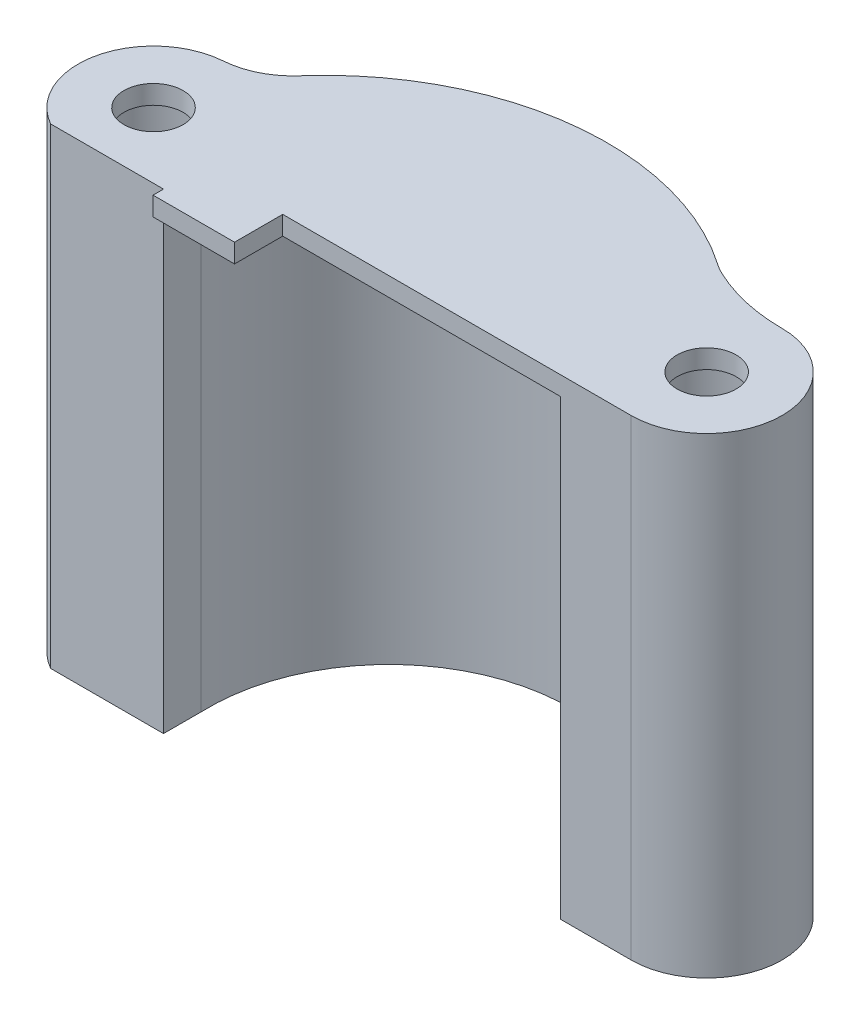
ISO-10303-21;
HEADER;
FILE_DESCRIPTION(('STEP AP214'),'2;1');
FILE_NAME('part.step','',(''),(''),'','','');
FILE_SCHEMA(('AUTOMOTIVE_DESIGN { 1 0 10303 214 1 1 1 1 }'));
ENDSEC;
DATA;
#1=APPLICATION_CONTEXT('core data for automotive mechanical design processes');
#2=APPLICATION_PROTOCOL_DEFINITION('international standard','automotive_design',2000,#1);
#3=PRODUCT_CONTEXT('',#1,'mechanical');
#4=PRODUCT('Part','Part','',(#3));
#5=PRODUCT_RELATED_PRODUCT_CATEGORY('part','',(#4));
#6=PRODUCT_DEFINITION_FORMATION('','',#4);
#7=PRODUCT_DEFINITION_CONTEXT('part definition',#1,'design');
#8=PRODUCT_DEFINITION('design','',#6,#7);
#9=PRODUCT_DEFINITION_SHAPE('','',#8);
#10=(LENGTH_UNIT() NAMED_UNIT(*) SI_UNIT(.MILLI.,.METRE.));
#11=(NAMED_UNIT(*) PLANE_ANGLE_UNIT() SI_UNIT($,.RADIAN.));
#12=(NAMED_UNIT(*) SI_UNIT($,.STERADIAN.) SOLID_ANGLE_UNIT());
#13=UNCERTAINTY_MEASURE_WITH_UNIT(LENGTH_MEASURE(1.E-05),#10,'distance_accuracy_value','');
#14=(GEOMETRIC_REPRESENTATION_CONTEXT(3) GLOBAL_UNCERTAINTY_ASSIGNED_CONTEXT((#13)) GLOBAL_UNIT_ASSIGNED_CONTEXT((#10,
#11,#12)) REPRESENTATION_CONTEXT('',''));
#15=CARTESIAN_POINT('',(0.,0.,0.));
#16=DIRECTION('',(0.,0.,1.));
#17=DIRECTION('',(1.,0.,0.));
#18=AXIS2_PLACEMENT_3D('',#15,#16,#17);
#19=CARTESIAN_POINT('',(-13.6378226737925,38.1,0.));
#20=DIRECTION('',(-1.,0.,0.));
#21=DIRECTION('',(0.,0.,1.));
#22=AXIS2_PLACEMENT_3D('',#19,#20,#21);
#23=PLANE('',#22);
#24=DIRECTION('',(0.,0.,1.));
#25=VECTOR('',#24,1.);
#26=CARTESIAN_POINT('',(-13.6378226737925,38.1,0.));
#27=LINE('',#26,#25);
#28=CARTESIAN_POINT('',(-13.6378226737925,38.1,15.7404965999173));
#29=VERTEX_POINT('',#28);
#30=CARTESIAN_POINT('',(-13.6378226737925,38.1,18.9154965999173));
#31=VERTEX_POINT('',#30);
#32=EDGE_CURVE('E280',#29,#31,#27,.T.);
#33=ORIENTED_EDGE('',*,*,#32,.T.);
#34=DIRECTION('',(0.,-1.,0.));
#35=VECTOR('',#34,1.);
#36=CARTESIAN_POINT('',(-13.6378226737925,38.1,18.9154965999173));
#37=LINE('',#36,#35);
#38=CARTESIAN_POINT('',(-13.6378226737925,0.,18.9154965999173));
#39=VERTEX_POINT('',#38);
#40=EDGE_CURVE('E236',#31,#39,#37,.T.);
#41=ORIENTED_EDGE('',*,*,#40,.T.);
#42=DIRECTION('',(0.,0.,-1.));
#43=VECTOR('',#42,1.);
#44=CARTESIAN_POINT('',(-13.6378226737925,0.,0.));
#45=LINE('',#44,#43);
#46=CARTESIAN_POINT('',(-13.6378226737925,0.,15.7404965999173));
#47=VERTEX_POINT('',#46);
#48=EDGE_CURVE('E206',#39,#47,#45,.T.);
#49=ORIENTED_EDGE('',*,*,#48,.T.);
#50=DIRECTION('',(0.,-1.,0.));
#51=VECTOR('',#50,1.);
#52=CARTESIAN_POINT('',(-13.6378226737925,38.1,15.7404965999173));
#53=LINE('',#52,#51);
#54=EDGE_CURVE('E233',#29,#47,#53,.T.);
#55=ORIENTED_EDGE('',*,*,#54,.F.);
#56=EDGE_LOOP('',(#33,#41,#49,#55));
#57=FACE_BOUND('',#56,.T.);
#58=ADVANCED_FACE('F38',(#57),#23,.F.);
#59=CARTESIAN_POINT('',(0.,38.1,15.7404965999173));
#60=DIRECTION('',(0.,0.,-1.));
#61=DIRECTION('',(-1.,0.,0.));
#62=AXIS2_PLACEMENT_3D('',#59,#60,#61);
#63=PLANE('',#62);
#64=DIRECTION('',(0.,1.,0.));
#65=VECTOR('',#64,1.);
#66=CARTESIAN_POINT('',(-6.77982267379246,17.7380475663924,15.7404965999173));
#67=LINE('',#66,#65);
#68=CARTESIAN_POINT('',(-6.77982267379246,38.1,15.7404965999173));
#69=VERTEX_POINT('',#68);
#70=CARTESIAN_POINT('',(-6.77982267379246,39.6875,15.7404965999173));
#71=VERTEX_POINT('',#70);
#72=EDGE_CURVE('E141',#69,#71,#67,.T.);
#73=ORIENTED_EDGE('',*,*,#72,.F.);
#74=DIRECTION('',(1.,0.,0.));
#75=VECTOR('',#74,1.);
#76=CARTESIAN_POINT('',(-13.6378226737925,38.1,15.7404965999173));
#77=LINE('',#76,#75);
#78=CARTESIAN_POINT('',(16.6090859378619,38.1,15.7404965999173));
#79=VERTEX_POINT('',#78);
#80=EDGE_CURVE('E168',#69,#79,#77,.T.);
#81=ORIENTED_EDGE('',*,*,#80,.T.);
#82=DIRECTION('',(0.,-1.,0.));
#83=VECTOR('',#82,1.);
#84=CARTESIAN_POINT('',(16.6090859378619,38.1,15.7404965999173));
#85=LINE('',#84,#83);
#86=CARTESIAN_POINT('',(16.6090859378619,0.,15.7404965999173));
#87=VERTEX_POINT('',#86);
#88=EDGE_CURVE('E228',#79,#87,#85,.T.);
#89=ORIENTED_EDGE('',*,*,#88,.T.);
#90=DIRECTION('',(1.,0.,0.));
#91=VECTOR('',#90,1.);
#92=CARTESIAN_POINT('',(0.,0.,15.7404965999173));
#93=LINE('',#92,#91);
#94=CARTESIAN_POINT('',(22.5456913931761,0.,15.7404965999173));
#95=VERTEX_POINT('',#94);
#96=EDGE_CURVE('E213',#87,#95,#93,.T.);
#97=ORIENTED_EDGE('',*,*,#96,.T.);
#98=DIRECTION('',(0.,-1.,0.));
#99=VECTOR('',#98,1.);
#100=CARTESIAN_POINT('',(22.5456913931761,38.1,15.7404965999173));
#101=LINE('',#100,#99);
#102=CARTESIAN_POINT('',(22.5456913931761,39.6875,15.7404965999173));
#103=VERTEX_POINT('',#102);
#104=EDGE_CURVE('E165',#103,#95,#101,.T.);
#105=ORIENTED_EDGE('',*,*,#104,.F.);
#106=DIRECTION('',(1.,0.,0.));
#107=VECTOR('',#106,1.);
#108=CARTESIAN_POINT('',(16.6090859378619,39.6875,15.7404965999173));
#109=LINE('',#108,#107);
#110=EDGE_CURVE('E157',#71,#103,#109,.T.);
#111=ORIENTED_EDGE('',*,*,#110,.F.);
#112=EDGE_LOOP('',(#73,#81,#89,#97,#105,#111));
#113=FACE_BOUND('',#112,.T.);
#114=ADVANCED_FACE('F163',(#113),#63,.F.);
#115=CARTESIAN_POINT('',(16.6090859378619,38.1,0.));
#116=DIRECTION('',(1.,0.,0.));
#117=DIRECTION('',(0.,0.,-1.));
#118=AXIS2_PLACEMENT_3D('',#115,#116,#117);
#119=PLANE('',#118);
#120=DIRECTION('',(0.,0.,-1.));
#121=VECTOR('',#120,1.);
#122=CARTESIAN_POINT('',(16.6090859378619,38.1,0.));
#123=LINE('',#122,#121);
#124=CARTESIAN_POINT('',(16.6090859378619,38.1,12.5654965999173));
#125=VERTEX_POINT('',#124);
#126=EDGE_CURVE('E291',#79,#125,#123,.T.);
#127=ORIENTED_EDGE('',*,*,#126,.T.);
#128=DIRECTION('',(0.,-1.,0.));
#129=VECTOR('',#128,1.);
#130=CARTESIAN_POINT('',(16.6090859378619,38.1,12.5654965999173));
#131=LINE('',#130,#129);
#132=CARTESIAN_POINT('',(16.6090859378619,0.,12.5654965999173));
#133=VERTEX_POINT('',#132);
#134=EDGE_CURVE('E230',#125,#133,#131,.T.);
#135=ORIENTED_EDGE('',*,*,#134,.T.);
#136=DIRECTION('',(0.,0.,1.));
#137=VECTOR('',#136,1.);
#138=CARTESIAN_POINT('',(16.6090859378619,0.,0.));
#139=LINE('',#138,#137);
#140=EDGE_CURVE('E210',#133,#87,#139,.T.);
#141=ORIENTED_EDGE('',*,*,#140,.T.);
#142=ORIENTED_EDGE('',*,*,#88,.F.);
#143=EDGE_LOOP('',(#127,#135,#141,#142));
#144=FACE_BOUND('',#143,.T.);
#145=ADVANCED_FACE('F330',(#144),#119,.F.);
#146=CARTESIAN_POINT('',(1.66297527786936,38.1,20.6134230140809));
#147=DIRECTION('',(0.,-1.,0.));
#148=DIRECTION('',(0.,0.,-1.));
#149=AXIS2_PLACEMENT_3D('',#146,#147,#148);
#150=CYLINDRICAL_SURFACE('',#149,23.746023500555);
#151=CARTESIAN_POINT('',(1.66297527786936,39.6875,20.6134230140809));
#152=DIRECTION('',(0.,1.,0.));
#153=DIRECTION('',(0.,0.,1.));
#154=AXIS2_PLACEMENT_3D('',#151,#152,#153);
#155=CIRCLE('',#154,23.746023500555);
#156=CARTESIAN_POINT('',(15.1487765830653,39.6875,1.06842889165444));
#157=VERTEX_POINT('',#156);
#158=CARTESIAN_POINT('',(-16.1639042572107,39.6875,4.92661332789374));
#159=VERTEX_POINT('',#158);
#160=EDGE_CURVE('E180',#157,#159,#155,.T.);
#161=ORIENTED_EDGE('',*,*,#160,.F.);
#162=DIRECTION('',(0.,-1.,0.));
#163=VECTOR('',#162,1.);
#164=CARTESIAN_POINT('',(15.1487765830653,38.1,1.06842889165443));
#165=LINE('',#164,#163);
#166=CARTESIAN_POINT('',(15.1487765830653,0.,1.06842889165443));
#167=VERTEX_POINT('',#166);
#168=EDGE_CURVE('E244',#157,#167,#165,.T.);
#169=ORIENTED_EDGE('',*,*,#168,.T.);
#170=CARTESIAN_POINT('',(1.66297527786936,0.,20.6134230140809));
#171=DIRECTION('',(0.,1.,0.));
#172=DIRECTION('',(0.,0.,1.));
#173=AXIS2_PLACEMENT_3D('',#170,#171,#172);
#174=CIRCLE('',#173,23.746023500555);
#175=CARTESIAN_POINT('',(-16.1639042572107,0.,4.92661332789373));
#176=VERTEX_POINT('',#175);
#177=EDGE_CURVE('E196',#176,#167,#174,.F.);
#178=ORIENTED_EDGE('',*,*,#177,.F.);
#179=DIRECTION('',(0.,-1.,0.));
#180=VECTOR('',#179,1.);
#181=CARTESIAN_POINT('',(-16.1639042572107,38.1,4.92661332789373));
#182=LINE('',#181,#180);
#183=EDGE_CURVE('E242',#176,#159,#182,.F.);
#184=ORIENTED_EDGE('',*,*,#183,.T.);
#185=EDGE_LOOP('',(#161,#169,#178,#184));
#186=FACE_BOUND('',#185,.T.);
#187=ADVANCED_FACE('F262',(#186),#150,.T.);
#188=CARTESIAN_POINT('',(-19.9966884261341,38.1,13.3973356971205));
#189=DIRECTION('',(0.,-1.,0.));
#190=DIRECTION('',(0.,0.,-1.));
#191=AXIS2_PLACEMENT_3D('',#188,#189,#190);
#192=CYLINDRICAL_SURFACE('',#191,6.35);
#193=CARTESIAN_POINT('',(-19.9966884261341,39.6875,13.3973356971205));
#194=DIRECTION('',(0.,1.,0.));
#195=DIRECTION('',(0.,0.,1.));
#196=AXIS2_PLACEMENT_3D('',#193,#194,#195);
#197=CIRCLE('',#196,6.35);
#198=CARTESIAN_POINT('',(-20.4638677435349,39.6875,7.06454456797428));
#199=VERTEX_POINT('',#198);
#200=CARTESIAN_POINT('',(-23.1387260215241,39.6875,18.9154965999173));
#201=VERTEX_POINT('',#200);
#202=EDGE_CURVE('E182',#199,#201,#197,.T.);
#203=ORIENTED_EDGE('',*,*,#202,.F.);
#204=DIRECTION('',(0.,-1.,0.));
#205=VECTOR('',#204,1.);
#206=CARTESIAN_POINT('',(-20.4638677435349,38.1,7.06454456797428));
#207=LINE('',#206,#205);
#208=CARTESIAN_POINT('',(-20.4638677435349,0.,7.06454456797428));
#209=VERTEX_POINT('',#208);
#210=EDGE_CURVE('E249',#199,#209,#207,.T.);
#211=ORIENTED_EDGE('',*,*,#210,.T.);
#212=CARTESIAN_POINT('',(-19.9966884261341,0.,13.3973356971205));
#213=DIRECTION('',(0.,1.,0.));
#214=DIRECTION('',(0.,0.,1.));
#215=AXIS2_PLACEMENT_3D('',#212,#213,#214);
#216=CIRCLE('',#215,6.35);
#217=CARTESIAN_POINT('',(-23.1387260215241,0.,18.9154965999173));
#218=VERTEX_POINT('',#217);
#219=EDGE_CURVE('E201',#209,#218,#216,.T.);
#220=ORIENTED_EDGE('',*,*,#219,.T.);
#221=DIRECTION('',(0.,-1.,0.));
#222=VECTOR('',#221,1.);
#223=CARTESIAN_POINT('',(-23.1387260215241,38.1,18.9154965999173));
#224=LINE('',#223,#222);
#225=EDGE_CURVE('E239',#201,#218,#224,.T.);
#226=ORIENTED_EDGE('',*,*,#225,.F.);
#227=EDGE_LOOP('',(#203,#211,#220,#226));
#228=FACE_BOUND('',#227,.T.);
#229=ADVANCED_FACE('F265',(#228),#192,.T.);
#230=CARTESIAN_POINT('',(0.,38.1,18.9154965999173));
#231=DIRECTION('',(0.,0.,-1.));
#232=DIRECTION('',(-1.,0.,0.));
#233=AXIS2_PLACEMENT_3D('',#230,#231,#232);
#234=PLANE('',#233);
#235=DIRECTION('',(1.,0.,0.));
#236=VECTOR('',#235,1.);
#237=CARTESIAN_POINT('',(0.,0.,18.9154965999173));
#238=LINE('',#237,#236);
#239=EDGE_CURVE('E203',#218,#39,#238,.T.);
#240=ORIENTED_EDGE('',*,*,#239,.T.);
#241=ORIENTED_EDGE('',*,*,#40,.F.);
#242=CARTESIAN_POINT('',(-13.6378226737925,39.6875,18.9154965999173));
#243=VERTEX_POINT('',#242);
#244=EDGE_CURVE('E237',#243,#31,#37,.T.);
#245=ORIENTED_EDGE('',*,*,#244,.F.);
#246=DIRECTION('',(1.,0.,0.));
#247=VECTOR('',#246,1.);
#248=CARTESIAN_POINT('',(-23.1387260215241,39.6875,18.9154965999173));
#249=LINE('',#248,#247);
#250=EDGE_CURVE('E184',#201,#243,#249,.T.);
#251=ORIENTED_EDGE('',*,*,#250,.F.);
#252=ORIENTED_EDGE('',*,*,#225,.T.);
#253=EDGE_LOOP('',(#240,#241,#245,#251,#252));
#254=FACE_BOUND('',#253,.T.);
#255=ADVANCED_FACE('F270',(#254),#234,.F.);
#256=CARTESIAN_POINT('',(1.59099250923585,38.1,15.1567259932861));
#257=DIRECTION('',(0.,-1.,0.));
#258=DIRECTION('',(0.,0.,-1.));
#259=AXIS2_PLACEMENT_3D('',#256,#257,#258);
#260=CYLINDRICAL_SURFACE('',#259,15.24);
#261=CARTESIAN_POINT('',(1.59099250923585,0.,15.1567259932861));
#262=DIRECTION('',(0.,1.,0.));
#263=DIRECTION('',(0.,0.,1.));
#264=AXIS2_PLACEMENT_3D('',#261,#262,#263);
#265=CIRCLE('',#264,15.24);
#266=EDGE_CURVE('E208',#47,#133,#265,.F.);
#267=ORIENTED_EDGE('',*,*,#266,.T.);
#268=ORIENTED_EDGE('',*,*,#134,.F.);
#269=CARTESIAN_POINT('',(1.59099250923585,38.1,15.1567259932861));
#270=DIRECTION('',(0.,1.,0.));
#271=DIRECTION('',(0.,0.,1.));
#272=AXIS2_PLACEMENT_3D('',#269,#270,#271);
#273=CIRCLE('',#272,15.24);
#274=EDGE_CURVE('E188',#29,#125,#273,.F.);
#275=ORIENTED_EDGE('',*,*,#274,.F.);
#276=ORIENTED_EDGE('',*,*,#54,.T.);
#277=EDGE_LOOP('',(#267,#268,#275,#276));
#278=FACE_BOUND('',#277,.T.);
#279=ADVANCED_FACE('F334',(#278),#260,.F.);
#280=CARTESIAN_POINT('',(22.545691393176,38.1,9.39049659991733));
#281=DIRECTION('',(0.,-1.,0.));
#282=DIRECTION('',(0.,0.,-1.));
#283=AXIS2_PLACEMENT_3D('',#280,#281,#282);
#284=CYLINDRICAL_SURFACE('',#283,6.35);
#285=CARTESIAN_POINT('',(22.545691393176,0.,9.39049659991733));
#286=DIRECTION('',(0.,1.,0.));
#287=DIRECTION('',(0.,0.,1.));
#288=AXIS2_PLACEMENT_3D('',#285,#286,#287);
#289=CIRCLE('',#288,6.35);
#290=CARTESIAN_POINT('',(22.545691393176,0.,3.04049659991733));
#291=VERTEX_POINT('',#290);
#292=EDGE_CURVE('E215',#95,#291,#289,.T.);
#293=ORIENTED_EDGE('',*,*,#292,.T.);
#294=DIRECTION('',(0.,-1.,0.));
#295=VECTOR('',#294,1.);
#296=CARTESIAN_POINT('',(22.545691393176,38.1,3.04049659991733));
#297=LINE('',#296,#295);
#298=CARTESIAN_POINT('',(22.545691393176,39.6875,3.04049659991733));
#299=VERTEX_POINT('',#298);
#300=EDGE_CURVE('E191',#299,#291,#297,.T.);
#301=ORIENTED_EDGE('',*,*,#300,.F.);
#302=CARTESIAN_POINT('',(22.545691393176,39.6875,9.39049659991733));
#303=DIRECTION('',(0.,1.,0.));
#304=DIRECTION('',(0.,0.,1.));
#305=AXIS2_PLACEMENT_3D('',#302,#303,#304);
#306=CIRCLE('',#305,6.35);
#307=EDGE_CURVE('E167',#103,#299,#306,.T.);
#308=ORIENTED_EDGE('',*,*,#307,.F.);
#309=ORIENTED_EDGE('',*,*,#104,.T.);
#310=EDGE_LOOP('',(#293,#301,#308,#309));
#311=FACE_BOUND('',#310,.T.);
#312=ADVANCED_FACE('F360',(#311),#284,.T.);
#313=CARTESIAN_POINT('',(22.545691393176,38.1,9.39049659991733));
#314=DIRECTION('',(0.,-1.,0.));
#315=DIRECTION('',(0.,0.,-1.));
#316=AXIS2_PLACEMENT_3D('',#313,#314,#315);
#317=CYLINDRICAL_SURFACE('',#316,4.7625);
#318=CARTESIAN_POINT('',(22.545691393176,38.1,9.39049659991733));
#319=DIRECTION('',(0.,1.,0.));
#320=DIRECTION('',(0.,0.,1.));
#321=AXIS2_PLACEMENT_3D('',#318,#319,#320);
#322=CIRCLE('',#321,4.7625);
#323=CARTESIAN_POINT('',(22.545691393176,38.1,14.1529965999173));
#324=VERTEX_POINT('',#323);
#325=EDGE_CURVE('E193',#324,#324,#322,.T.);
#326=ORIENTED_EDGE('',*,*,#325,.T.);
#327=EDGE_LOOP('',(#326));
#328=FACE_BOUND('',#327,.T.);
#329=CARTESIAN_POINT('',(22.545691393176,0.,9.39049659991733));
#330=DIRECTION('',(0.,1.,0.));
#331=DIRECTION('',(0.,0.,1.));
#332=AXIS2_PLACEMENT_3D('',#329,#330,#331);
#333=CIRCLE('',#332,4.7625);
#334=CARTESIAN_POINT('',(22.545691393176,0.,14.1529965999173));
#335=VERTEX_POINT('',#334);
#336=EDGE_CURVE('E220',#335,#335,#333,.T.);
#337=ORIENTED_EDGE('',*,*,#336,.F.);
#338=EDGE_LOOP('',(#337));
#339=FACE_BOUND('',#338,.T.);
#340=ADVANCED_FACE('F362',(#328,#339),#317,.F.);
#341=CARTESIAN_POINT('',(22.545691393176,38.1,-12.1995034000827));
#342=DIRECTION('',(0.,-1.,0.));
#343=DIRECTION('',(0.,0.,-1.));
#344=AXIS2_PLACEMENT_3D('',#341,#342,#343);
#345=CYLINDRICAL_SURFACE('',#344,15.24);
#346=CARTESIAN_POINT('',(22.545691393176,0.,-12.1995034000827));
#347=DIRECTION('',(0.,1.,0.));
#348=DIRECTION('',(0.,0.,1.));
#349=AXIS2_PLACEMENT_3D('',#346,#347,#348);
#350=CIRCLE('',#349,15.24);
#351=CARTESIAN_POINT('',(16.0474623590527,0.,1.58565599036608));
#352=VERTEX_POINT('',#351);
#353=EDGE_CURVE('E217',#291,#352,#350,.F.);
#354=ORIENTED_EDGE('',*,*,#353,.T.);
#355=DIRECTION('',(0.,-1.,0.));
#356=VECTOR('',#355,1.);
#357=CARTESIAN_POINT('',(16.0474623590527,38.1,1.58565599036608));
#358=LINE('',#357,#356);
#359=CARTESIAN_POINT('',(16.0474623590527,39.6875,1.58565599036608));
#360=VERTEX_POINT('',#359);
#361=EDGE_CURVE('E247',#352,#360,#358,.F.);
#362=ORIENTED_EDGE('',*,*,#361,.T.);
#363=CARTESIAN_POINT('',(22.545691393176,39.6875,-12.1995034000827));
#364=DIRECTION('',(0.,-1.,0.));
#365=DIRECTION('',(0.,0.,1.));
#366=AXIS2_PLACEMENT_3D('',#363,#364,#365);
#367=CIRCLE('',#366,15.24);
#368=EDGE_CURVE('E170',#299,#360,#367,.T.);
#369=ORIENTED_EDGE('',*,*,#368,.F.);
#370=ORIENTED_EDGE('',*,*,#300,.T.);
#371=EDGE_LOOP('',(#354,#362,#369,#370));
#372=FACE_BOUND('',#371,.T.);
#373=ADVANCED_FACE('F354',(#372),#345,.F.);
#374=CARTESIAN_POINT('',(-19.9966884261341,38.1,13.3973356971205));
#375=DIRECTION('',(0.,-1.,0.));
#376=DIRECTION('',(0.,0.,-1.));
#377=AXIS2_PLACEMENT_3D('',#374,#375,#376);
#378=CYLINDRICAL_SURFACE('',#377,4.7625);
#379=CARTESIAN_POINT('',(-19.9966884261341,38.1,13.3973356971205));
#380=DIRECTION('',(0.,1.,0.));
#381=DIRECTION('',(0.,0.,1.));
#382=AXIS2_PLACEMENT_3D('',#379,#380,#381);
#383=CIRCLE('',#382,4.7625);
#384=CARTESIAN_POINT('',(-19.9966884261341,38.1,18.1598356971205));
#385=VERTEX_POINT('',#384);
#386=EDGE_CURVE('E186',#385,#385,#383,.T.);
#387=ORIENTED_EDGE('',*,*,#386,.T.);
#388=EDGE_LOOP('',(#387));
#389=FACE_BOUND('',#388,.T.);
#390=CARTESIAN_POINT('',(-19.9966884261341,0.,13.3973356971205));
#391=DIRECTION('',(0.,1.,0.));
#392=DIRECTION('',(0.,0.,1.));
#393=AXIS2_PLACEMENT_3D('',#390,#391,#392);
#394=CIRCLE('',#393,4.7625);
#395=CARTESIAN_POINT('',(-19.9966884261341,0.,18.1598356971205));
#396=VERTEX_POINT('',#395);
#397=EDGE_CURVE('E192',#396,#396,#394,.T.);
#398=ORIENTED_EDGE('',*,*,#397,.F.);
#399=EDGE_LOOP('',(#398));
#400=FACE_BOUND('',#399,.T.);
#401=ADVANCED_FACE('F484',(#389,#400),#378,.F.);
#402=CARTESIAN_POINT('',(0.,0.,0.));
#403=DIRECTION('',(0.,1.,0.));
#404=DIRECTION('',(0.,0.,1.));
#405=AXIS2_PLACEMENT_3D('',#402,#403,#404);
#406=PLANE('',#405);
#407=ORIENTED_EDGE('',*,*,#219,.F.);
#408=CARTESIAN_POINT('',(-20.9310470609358,0.,0.731753438828078));
#409=DIRECTION('',(0.,1.,0.));
#410=DIRECTION('',(0.,0.,1.));
#411=AXIS2_PLACEMENT_3D('',#408,#409,#410);
#412=CIRCLE('',#411,6.35);
#413=EDGE_CURVE('E46',#209,#176,#412,.T.);
#414=ORIENTED_EDGE('',*,*,#413,.T.);
#415=ORIENTED_EDGE('',*,*,#177,.T.);
#416=CARTESIAN_POINT('',(18.7550577899374,0.,-4.1581604223209));
#417=DIRECTION('',(0.,1.,0.));
#418=DIRECTION('',(0.,0.,1.));
#419=AXIS2_PLACEMENT_3D('',#416,#417,#418);
#420=CIRCLE('',#419,6.35);
#421=EDGE_CURVE('E251',#167,#352,#420,.T.);
#422=ORIENTED_EDGE('',*,*,#421,.T.);
#423=ORIENTED_EDGE('',*,*,#353,.F.);
#424=ORIENTED_EDGE('',*,*,#292,.F.);
#425=ORIENTED_EDGE('',*,*,#96,.F.);
#426=ORIENTED_EDGE('',*,*,#140,.F.);
#427=ORIENTED_EDGE('',*,*,#266,.F.);
#428=ORIENTED_EDGE('',*,*,#48,.F.);
#429=ORIENTED_EDGE('',*,*,#239,.F.);
#430=EDGE_LOOP('',(#407,#414,#415,#422,#423,#424,#425,#426,#427,#428,#429));
#431=FACE_BOUND('',#430,.T.);
#432=ORIENTED_EDGE('',*,*,#336,.T.);
#433=EDGE_LOOP('',(#432));
#434=FACE_BOUND('',#433,.T.);
#435=ORIENTED_EDGE('',*,*,#397,.T.);
#436=EDGE_LOOP('',(#435));
#437=FACE_BOUND('',#436,.T.);
#438=ADVANCED_FACE('F257',(#431,#434,#437),#406,.F.);
#439=CARTESIAN_POINT('',(22.545691393176,38.1,9.39049659991733));
#440=DIRECTION('',(0.,1.,0.));
#441=DIRECTION('',(0.,0.,1.));
#442=AXIS2_PLACEMENT_3D('',#439,#440,#441);
#443=PLANE('',#442);
#444=ORIENTED_EDGE('',*,*,#80,.F.);
#445=DIRECTION('',(0.,0.,-1.));
#446=VECTOR('',#445,1.);
#447=CARTESIAN_POINT('',(-6.77982267379246,38.1,0.));
#448=LINE('',#447,#446);
#449=CARTESIAN_POINT('',(-6.77982267379246,38.1,19.7970649049161));
#450=VERTEX_POINT('',#449);
#451=EDGE_CURVE('E147',#450,#69,#448,.T.);
#452=ORIENTED_EDGE('',*,*,#451,.F.);
#453=DIRECTION('',(-1.,0.,0.));
#454=VECTOR('',#453,1.);
#455=CARTESIAN_POINT('',(0.,38.1,19.7970649049161));
#456=LINE('',#455,#454);
#457=CARTESIAN_POINT('',(-13.6378226737925,38.1,19.7970649049161));
#458=VERTEX_POINT('',#457);
#459=EDGE_CURVE('E283',#450,#458,#456,.T.);
#460=ORIENTED_EDGE('',*,*,#459,.T.);
#461=EDGE_CURVE('E275',#31,#458,#27,.T.);
#462=ORIENTED_EDGE('',*,*,#461,.F.);
#463=ORIENTED_EDGE('',*,*,#32,.F.);
#464=ORIENTED_EDGE('',*,*,#274,.T.);
#465=ORIENTED_EDGE('',*,*,#126,.F.);
#466=EDGE_LOOP('',(#444,#452,#460,#462,#463,#464,#465));
#467=FACE_BOUND('',#466,.T.);
#468=ADVANCED_FACE('F279',(#467),#443,.F.);
#469=ORIENTED_EDGE('',*,*,#325,.F.);
#470=EDGE_LOOP('',(#469));
#471=FACE_BOUND('',#470,.T.);
#472=CARTESIAN_POINT('',(22.545691393176,38.1,9.39049659991733));
#473=DIRECTION('',(0.,1.,0.));
#474=DIRECTION('',(0.,0.,1.));
#475=AXIS2_PLACEMENT_3D('',#472,#473,#474);
#476=CIRCLE('',#475,2.4892);
#477=CARTESIAN_POINT('',(22.545691393176,38.1,11.8796965999173));
#478=VERTEX_POINT('',#477);
#479=EDGE_CURVE('E175',#478,#478,#476,.T.);
#480=ORIENTED_EDGE('',*,*,#479,.T.);
#481=EDGE_LOOP('',(#480));
#482=FACE_BOUND('',#481,.T.);
#483=ADVANCED_FACE('F309',(#471,#482),#443,.F.);
#484=CARTESIAN_POINT('',(22.545691393176,39.6875,9.39049659991733));
#485=DIRECTION('',(0.,1.,0.));
#486=DIRECTION('',(0.,0.,1.));
#487=AXIS2_PLACEMENT_3D('',#484,#485,#486);
#488=PLANE('',#487);
#489=DIRECTION('',(0.,0.,1.));
#490=VECTOR('',#489,1.);
#491=CARTESIAN_POINT('',(-6.77982267379246,39.6875,0.));
#492=LINE('',#491,#490);
#493=CARTESIAN_POINT('',(-6.77982267379246,39.6875,19.7970649049161));
#494=VERTEX_POINT('',#493);
#495=EDGE_CURVE('E145',#71,#494,#492,.T.);
#496=ORIENTED_EDGE('',*,*,#495,.F.);
#497=ORIENTED_EDGE('',*,*,#110,.T.);
#498=ORIENTED_EDGE('',*,*,#307,.T.);
#499=ORIENTED_EDGE('',*,*,#368,.T.);
#500=CARTESIAN_POINT('',(18.7550577899374,39.6875,-4.1581604223209));
#501=DIRECTION('',(0.,1.,0.));
#502=DIRECTION('',(0.,0.,1.));
#503=AXIS2_PLACEMENT_3D('',#500,#501,#502);
#504=CIRCLE('',#503,6.35);
#505=EDGE_CURVE('E253',#360,#157,#504,.F.);
#506=ORIENTED_EDGE('',*,*,#505,.T.);
#507=ORIENTED_EDGE('',*,*,#160,.T.);
#508=CARTESIAN_POINT('',(-20.9310470609358,39.6875,0.731753438828078));
#509=DIRECTION('',(0.,1.,0.));
#510=DIRECTION('',(0.,0.,1.));
#511=AXIS2_PLACEMENT_3D('',#508,#509,#510);
#512=CIRCLE('',#511,6.35);
#513=EDGE_CURVE('E11',#159,#199,#512,.F.);
#514=ORIENTED_EDGE('',*,*,#513,.T.);
#515=ORIENTED_EDGE('',*,*,#202,.T.);
#516=ORIENTED_EDGE('',*,*,#250,.T.);
#517=DIRECTION('',(0.,0.,-1.));
#518=VECTOR('',#517,1.);
#519=CARTESIAN_POINT('',(-13.6378226737925,39.6875,0.));
#520=LINE('',#519,#518);
#521=CARTESIAN_POINT('',(-13.6378226737925,39.6875,19.7970649049161));
#522=VERTEX_POINT('',#521);
#523=EDGE_CURVE('E161',#522,#243,#520,.T.);
#524=ORIENTED_EDGE('',*,*,#523,.F.);
#525=DIRECTION('',(1.,0.,0.));
#526=VECTOR('',#525,1.);
#527=CARTESIAN_POINT('',(0.,39.6875,19.7970649049161));
#528=LINE('',#527,#526);
#529=EDGE_CURVE('E152',#522,#494,#528,.T.);
#530=ORIENTED_EDGE('',*,*,#529,.T.);
#531=EDGE_LOOP('',(#496,#497,#498,#499,#506,#507,#514,#515,#516,#524,#530));
#532=FACE_BOUND('',#531,.T.);
#533=CARTESIAN_POINT('',(22.545691393176,39.6875,9.39049659991733));
#534=DIRECTION('',(0.,1.,0.));
#535=DIRECTION('',(0.,0.,1.));
#536=AXIS2_PLACEMENT_3D('',#533,#534,#535);
#537=CIRCLE('',#536,2.4892);
#538=CARTESIAN_POINT('',(22.545691393176,39.6875,11.8796965999173));
#539=VERTEX_POINT('',#538);
#540=EDGE_CURVE('E172',#539,#539,#537,.T.);
#541=ORIENTED_EDGE('',*,*,#540,.F.);
#542=EDGE_LOOP('',(#541));
#543=FACE_BOUND('',#542,.T.);
#544=CARTESIAN_POINT('',(-19.9966884261341,39.6875,13.3973356971205));
#545=DIRECTION('',(0.,1.,0.));
#546=DIRECTION('',(0.,0.,1.));
#547=AXIS2_PLACEMENT_3D('',#544,#545,#546);
#548=CIRCLE('',#547,2.4892);
#549=CARTESIAN_POINT('',(-19.9966884261341,39.6875,15.8865356971205));
#550=VERTEX_POINT('',#549);
#551=EDGE_CURVE('E299',#550,#550,#548,.T.);
#552=ORIENTED_EDGE('',*,*,#551,.F.);
#553=EDGE_LOOP('',(#552));
#554=FACE_BOUND('',#553,.T.);
#555=ADVANCED_FACE('F154',(#532,#543,#554),#488,.T.);
#556=ORIENTED_EDGE('',*,*,#386,.F.);
#557=EDGE_LOOP('',(#556));
#558=FACE_BOUND('',#557,.T.);
#559=CARTESIAN_POINT('',(-19.9966884261341,38.1,13.3973356971205));
#560=DIRECTION('',(0.,1.,0.));
#561=DIRECTION('',(0.,0.,1.));
#562=AXIS2_PLACEMENT_3D('',#559,#560,#561);
#563=CIRCLE('',#562,2.4892);
#564=CARTESIAN_POINT('',(-19.9966884261341,38.1,15.8865356971205));
#565=VERTEX_POINT('',#564);
#566=EDGE_CURVE('E298',#565,#565,#563,.T.);
#567=ORIENTED_EDGE('',*,*,#566,.T.);
#568=EDGE_LOOP('',(#567));
#569=FACE_BOUND('',#568,.T.);
#570=ADVANCED_FACE('F314',(#558,#569),#443,.F.);
#571=CARTESIAN_POINT('',(22.545691393176,39.6875,9.39049659991733));
#572=DIRECTION('',(0.,-1.,0.));
#573=DIRECTION('',(0.,0.,-1.));
#574=AXIS2_PLACEMENT_3D('',#571,#572,#573);
#575=CYLINDRICAL_SURFACE('',#574,2.4892);
#576=ORIENTED_EDGE('',*,*,#540,.T.);
#577=EDGE_LOOP('',(#576));
#578=FACE_BOUND('',#577,.T.);
#579=ORIENTED_EDGE('',*,*,#479,.F.);
#580=EDGE_LOOP('',(#579));
#581=FACE_BOUND('',#580,.T.);
#582=ADVANCED_FACE('F311',(#578,#581),#575,.F.);
#583=CARTESIAN_POINT('',(-19.9966884261341,39.6875,13.3973356971205));
#584=DIRECTION('',(0.,-1.,0.));
#585=DIRECTION('',(0.,0.,-1.));
#586=AXIS2_PLACEMENT_3D('',#583,#584,#585);
#587=CYLINDRICAL_SURFACE('',#586,2.4892);
#588=ORIENTED_EDGE('',*,*,#551,.T.);
#589=EDGE_LOOP('',(#588));
#590=FACE_BOUND('',#589,.T.);
#591=ORIENTED_EDGE('',*,*,#566,.F.);
#592=EDGE_LOOP('',(#591));
#593=FACE_BOUND('',#592,.T.);
#594=ADVANCED_FACE('F313',(#590,#593),#587,.F.);
#595=CARTESIAN_POINT('',(-13.6378226737925,17.7380475663924,0.));
#596=DIRECTION('',(1.,0.,0.));
#597=DIRECTION('',(0.,0.,-1.));
#598=AXIS2_PLACEMENT_3D('',#595,#596,#597);
#599=PLANE('',#598);
#600=ORIENTED_EDGE('',*,*,#523,.T.);
#601=ORIENTED_EDGE('',*,*,#244,.T.);
#602=ORIENTED_EDGE('',*,*,#461,.T.);
#603=DIRECTION('',(0.,1.,0.));
#604=VECTOR('',#603,1.);
#605=CARTESIAN_POINT('',(-13.6378226737925,17.7380475663924,19.7970649049161));
#606=LINE('',#605,#604);
#607=EDGE_CURVE('E151',#458,#522,#606,.T.);
#608=ORIENTED_EDGE('',*,*,#607,.T.);
#609=EDGE_LOOP('',(#600,#601,#602,#608));
#610=FACE_BOUND('',#609,.T.);
#611=ADVANCED_FACE('F274',(#610),#599,.F.);
#612=CARTESIAN_POINT('',(0.,17.7380475663924,19.7970649049161));
#613=DIRECTION('',(0.,0.,1.));
#614=DIRECTION('',(1.,0.,0.));
#615=AXIS2_PLACEMENT_3D('',#612,#613,#614);
#616=PLANE('',#615);
#617=ORIENTED_EDGE('',*,*,#459,.F.);
#618=DIRECTION('',(0.,1.,0.));
#619=VECTOR('',#618,1.);
#620=CARTESIAN_POINT('',(-6.77982267379246,17.7380475663924,19.7970649049161));
#621=LINE('',#620,#619);
#622=EDGE_CURVE('E285',#450,#494,#621,.T.);
#623=ORIENTED_EDGE('',*,*,#622,.T.);
#624=ORIENTED_EDGE('',*,*,#529,.F.);
#625=ORIENTED_EDGE('',*,*,#607,.F.);
#626=EDGE_LOOP('',(#617,#623,#624,#625));
#627=FACE_BOUND('',#626,.T.);
#628=ADVANCED_FACE('F348',(#627),#616,.T.);
#629=CARTESIAN_POINT('',(-6.77982267379246,17.7380475663924,0.));
#630=DIRECTION('',(-1.,0.,0.));
#631=DIRECTION('',(0.,0.,1.));
#632=AXIS2_PLACEMENT_3D('',#629,#630,#631);
#633=PLANE('',#632);
#634=ORIENTED_EDGE('',*,*,#622,.F.);
#635=ORIENTED_EDGE('',*,*,#451,.T.);
#636=ORIENTED_EDGE('',*,*,#72,.T.);
#637=ORIENTED_EDGE('',*,*,#495,.T.);
#638=EDGE_LOOP('',(#634,#635,#636,#637));
#639=FACE_BOUND('',#638,.T.);
#640=ADVANCED_FACE('F144',(#639),#633,.F.);
#641=CARTESIAN_POINT('',(18.7550577899374,38.1,-4.1581604223209));
#642=DIRECTION('',(0.,-1.,0.));
#643=DIRECTION('',(0.,0.,-1.));
#644=AXIS2_PLACEMENT_3D('',#641,#642,#643);
#645=CYLINDRICAL_SURFACE('',#644,6.35);
#646=ORIENTED_EDGE('',*,*,#505,.F.);
#647=ORIENTED_EDGE('',*,*,#361,.F.);
#648=ORIENTED_EDGE('',*,*,#421,.F.);
#649=ORIENTED_EDGE('',*,*,#168,.F.);
#650=EDGE_LOOP('',(#646,#647,#648,#649));
#651=FACE_BOUND('',#650,.T.);
#652=ADVANCED_FACE('F341',(#651),#645,.F.);
#653=CARTESIAN_POINT('',(-20.9310470609358,38.1,0.731753438828078));
#654=DIRECTION('',(0.,1.,0.));
#655=DIRECTION('',(0.,0.,1.));
#656=AXIS2_PLACEMENT_3D('',#653,#654,#655);
#657=CYLINDRICAL_SURFACE('',#656,6.35);
#658=ORIENTED_EDGE('',*,*,#513,.F.);
#659=ORIENTED_EDGE('',*,*,#183,.F.);
#660=ORIENTED_EDGE('',*,*,#413,.F.);
#661=ORIENTED_EDGE('',*,*,#210,.F.);
#662=EDGE_LOOP('',(#658,#659,#660,#661));
#663=FACE_BOUND('',#662,.T.);
#664=ADVANCED_FACE('F40',(#663),#657,.F.);
#665=CLOSED_SHELL('',(#58,#114,#145,#187,#229,#255,#279,#312,#340,#373,#401,#438,#468,#483,#555,
#570,#582,#594,#611,#628,#640,#652,#664));
#666=MANIFOLD_SOLID_BREP('B2',#665);
#667=ADVANCED_BREP_SHAPE_REPRESENTATION('',(#18,#666),#14);
#668=SHAPE_DEFINITION_REPRESENTATION(#9,#667);
ENDSEC;
END-ISO-10303-21;
